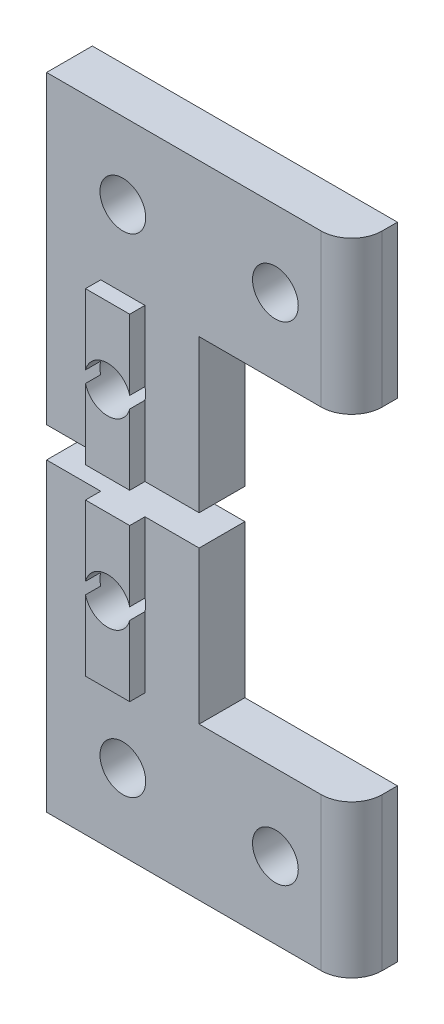
ISO-10303-21;
HEADER;
FILE_DESCRIPTION(('STEP AP214'),'2;1');
FILE_NAME('part.step','',(''),(''),'','','');
FILE_SCHEMA(('AUTOMOTIVE_DESIGN { 1 0 10303 214 1 1 1 1 }'));
ENDSEC;
DATA;
#1=APPLICATION_CONTEXT('core data for automotive mechanical design processes');
#2=APPLICATION_PROTOCOL_DEFINITION('international standard','automotive_design',2000,#1);
#3=PRODUCT_CONTEXT('',#1,'mechanical');
#4=PRODUCT('Part','Part','',(#3));
#5=PRODUCT_RELATED_PRODUCT_CATEGORY('part','',(#4));
#6=PRODUCT_DEFINITION_FORMATION('','',#4);
#7=PRODUCT_DEFINITION_CONTEXT('part definition',#1,'design');
#8=PRODUCT_DEFINITION('design','',#6,#7);
#9=PRODUCT_DEFINITION_SHAPE('','',#8);
#10=(LENGTH_UNIT() NAMED_UNIT(*) SI_UNIT(.MILLI.,.METRE.));
#11=(NAMED_UNIT(*) PLANE_ANGLE_UNIT() SI_UNIT($,.RADIAN.));
#12=(NAMED_UNIT(*) SI_UNIT($,.STERADIAN.) SOLID_ANGLE_UNIT());
#13=UNCERTAINTY_MEASURE_WITH_UNIT(LENGTH_MEASURE(1.E-05),#10,'distance_accuracy_value','');
#14=(GEOMETRIC_REPRESENTATION_CONTEXT(3) GLOBAL_UNCERTAINTY_ASSIGNED_CONTEXT((#13)) GLOBAL_UNIT_ASSIGNED_CONTEXT((#10,
#11,#12)) REPRESENTATION_CONTEXT('',''));
#15=CARTESIAN_POINT('',(0.,0.,0.));
#16=DIRECTION('',(0.,0.,1.));
#17=DIRECTION('',(1.,0.,0.));
#18=AXIS2_PLACEMENT_3D('',#15,#16,#17);
#19=CARTESIAN_POINT('',(3.55,22.,4.));
#20=DIRECTION('',(1.,0.,0.));
#21=DIRECTION('',(0.,-1.,0.));
#22=AXIS2_PLACEMENT_3D('',#19,#20,#21);
#23=PLANE('',#22);
#24=DIRECTION('',(0.,1.,0.));
#25=VECTOR('',#24,1.);
#26=CARTESIAN_POINT('',(3.55,22.,3.));
#27=LINE('',#26,#25);
#28=CARTESIAN_POINT('',(3.55,22.,3.));
#29=VERTEX_POINT('',#28);
#30=CARTESIAN_POINT('',(3.55,26.6159427126066,3.));
#31=VERTEX_POINT('',#30);
#32=EDGE_CURVE('E197',#29,#31,#27,.T.);
#33=ORIENTED_EDGE('',*,*,#32,.F.);
#34=DIRECTION('',(0.,0.,-1.));
#35=VECTOR('',#34,1.);
#36=CARTESIAN_POINT('',(3.55,22.,4.));
#37=LINE('',#36,#35);
#38=CARTESIAN_POINT('',(3.55,22.,4.));
#39=VERTEX_POINT('',#38);
#40=EDGE_CURVE('E196',#39,#29,#37,.T.);
#41=ORIENTED_EDGE('',*,*,#40,.F.);
#42=DIRECTION('',(0.,1.,0.));
#43=VECTOR('',#42,1.);
#44=CARTESIAN_POINT('',(3.55,22.,4.));
#45=LINE('',#44,#43);
#46=CARTESIAN_POINT('',(3.55,26.6159427126066,4.));
#47=VERTEX_POINT('',#46);
#48=EDGE_CURVE('E190',#39,#47,#45,.T.);
#49=ORIENTED_EDGE('',*,*,#48,.T.);
#50=DIRECTION('',(0.,0.,1.));
#51=VECTOR('',#50,1.);
#52=CARTESIAN_POINT('',(3.55,26.6159427126066,0.));
#53=LINE('',#52,#51);
#54=EDGE_CURVE('E171',#31,#47,#53,.T.);
#55=ORIENTED_EDGE('',*,*,#54,.F.);
#56=EDGE_LOOP('',(#33,#41,#49,#55));
#57=FACE_BOUND('',#56,.T.);
#58=ADVANCED_FACE('F43',(#57),#23,.F.);
#59=CARTESIAN_POINT('',(6.45,22.,4.));
#60=DIRECTION('',(-1.,0.,0.));
#61=DIRECTION('',(0.,1.,0.));
#62=AXIS2_PLACEMENT_3D('',#59,#60,#61);
#63=PLANE('',#62);
#64=DIRECTION('',(0.,-1.,0.));
#65=VECTOR('',#64,1.);
#66=CARTESIAN_POINT('',(6.45,22.,3.));
#67=LINE('',#66,#65);
#68=CARTESIAN_POINT('',(6.45,32.,3.));
#69=VERTEX_POINT('',#68);
#70=CARTESIAN_POINT('',(6.45,27.3840572873934,3.));
#71=VERTEX_POINT('',#70);
#72=EDGE_CURVE('E202',#69,#71,#67,.T.);
#73=ORIENTED_EDGE('',*,*,#72,.F.);
#74=DIRECTION('',(0.,0.,-1.));
#75=VECTOR('',#74,1.);
#76=CARTESIAN_POINT('',(6.45,32.,4.));
#77=LINE('',#76,#75);
#78=CARTESIAN_POINT('',(6.45,32.,4.));
#79=VERTEX_POINT('',#78);
#80=EDGE_CURVE('E209',#79,#69,#77,.T.);
#81=ORIENTED_EDGE('',*,*,#80,.F.);
#82=DIRECTION('',(0.,-1.,0.));
#83=VECTOR('',#82,1.);
#84=CARTESIAN_POINT('',(6.45,22.,4.));
#85=LINE('',#84,#83);
#86=CARTESIAN_POINT('',(6.45,27.3840572873934,4.));
#87=VERTEX_POINT('',#86);
#88=EDGE_CURVE('E166',#79,#87,#85,.T.);
#89=ORIENTED_EDGE('',*,*,#88,.T.);
#90=DIRECTION('',(0.,0.,1.));
#91=VECTOR('',#90,1.);
#92=CARTESIAN_POINT('',(6.45,27.3840572873934,0.));
#93=LINE('',#92,#91);
#94=EDGE_CURVE('E182',#71,#87,#93,.T.);
#95=ORIENTED_EDGE('',*,*,#94,.F.);
#96=EDGE_LOOP('',(#73,#81,#89,#95));
#97=FACE_BOUND('',#96,.T.);
#98=ADVANCED_FACE('F313',(#97),#63,.F.);
#99=CARTESIAN_POINT('',(0.,42.,4.));
#100=DIRECTION('',(0.,0.,1.));
#101=DIRECTION('',(1.,0.,0.));
#102=AXIS2_PLACEMENT_3D('',#99,#100,#101);
#103=PLANE('',#102);
#104=CARTESIAN_POINT('',(5.,27.,4.));
#105=DIRECTION('',(0.,0.,-1.));
#106=DIRECTION('',(1.,0.,0.));
#107=AXIS2_PLACEMENT_3D('',#104,#105,#106);
#108=CIRCLE('',#107,1.5);
#109=CARTESIAN_POINT('',(6.45,26.6159427126066,4.));
#110=VERTEX_POINT('',#109);
#111=EDGE_CURVE('E163',#110,#47,#108,.T.);
#112=ORIENTED_EDGE('',*,*,#111,.T.);
#113=ORIENTED_EDGE('',*,*,#48,.F.);
#114=DIRECTION('',(-1.,0.,0.));
#115=VECTOR('',#114,1.);
#116=CARTESIAN_POINT('',(3.55,22.,4.));
#117=LINE('',#116,#115);
#118=CARTESIAN_POINT('',(6.45,22.,4.));
#119=VERTEX_POINT('',#118);
#120=EDGE_CURVE('E165',#119,#39,#117,.T.);
#121=ORIENTED_EDGE('',*,*,#120,.F.);
#122=EDGE_CURVE('E151',#110,#119,#85,.T.);
#123=ORIENTED_EDGE('',*,*,#122,.F.);
#124=EDGE_LOOP('',(#112,#113,#121,#123));
#125=FACE_BOUND('',#124,.T.);
#126=ADVANCED_FACE('F161',(#125),#103,.T.);
#127=CARTESIAN_POINT('',(0.,22.,3.));
#128=DIRECTION('',(1.,0.,0.));
#129=DIRECTION('',(0.,-1.,0.));
#130=AXIS2_PLACEMENT_3D('',#127,#128,#129);
#131=PLANE('',#130);
#132=DIRECTION('',(0.,1.,0.));
#133=VECTOR('',#132,1.);
#134=CARTESIAN_POINT('',(0.,22.,0.));
#135=LINE('',#134,#133);
#136=CARTESIAN_POINT('',(0.,22.,0.));
#137=VERTEX_POINT('',#136);
#138=CARTESIAN_POINT('',(0.,42.,0.));
#139=VERTEX_POINT('',#138);
#140=EDGE_CURVE('E214',#137,#139,#135,.T.);
#141=ORIENTED_EDGE('',*,*,#140,.F.);
#142=DIRECTION('',(0.,0.,-1.));
#143=VECTOR('',#142,1.);
#144=CARTESIAN_POINT('',(0.,22.,3.));
#145=LINE('',#144,#143);
#146=CARTESIAN_POINT('',(0.,22.,3.));
#147=VERTEX_POINT('',#146);
#148=EDGE_CURVE('E232',#147,#137,#145,.T.);
#149=ORIENTED_EDGE('',*,*,#148,.F.);
#150=DIRECTION('',(0.,1.,0.));
#151=VECTOR('',#150,1.);
#152=CARTESIAN_POINT('',(0.,22.,3.));
#153=LINE('',#152,#151);
#154=CARTESIAN_POINT('',(0.,42.,3.));
#155=VERTEX_POINT('',#154);
#156=EDGE_CURVE('E215',#147,#155,#153,.T.);
#157=ORIENTED_EDGE('',*,*,#156,.T.);
#158=DIRECTION('',(0.,0.,-1.));
#159=VECTOR('',#158,1.);
#160=CARTESIAN_POINT('',(0.,42.,3.));
#161=LINE('',#160,#159);
#162=EDGE_CURVE('E262',#155,#139,#161,.T.);
#163=ORIENTED_EDGE('',*,*,#162,.T.);
#164=EDGE_LOOP('',(#141,#149,#157,#163));
#165=FACE_BOUND('',#164,.T.);
#166=ADVANCED_FACE('F291',(#165),#131,.F.);
#167=CARTESIAN_POINT('',(0.,42.,3.));
#168=DIRECTION('',(0.,-1.,0.));
#169=DIRECTION('',(0.,0.,1.));
#170=AXIS2_PLACEMENT_3D('',#167,#168,#169);
#171=PLANE('',#170);
#172=DIRECTION('',(0.,0.,-1.));
#173=VECTOR('',#172,1.);
#174=CARTESIAN_POINT('',(20.,42.,3.));
#175=LINE('',#174,#173);
#176=CARTESIAN_POINT('',(20.,42.,1.));
#177=VERTEX_POINT('',#176);
#178=CARTESIAN_POINT('',(20.,42.,0.));
#179=VERTEX_POINT('',#178);
#180=EDGE_CURVE('E259',#177,#179,#175,.T.);
#181=ORIENTED_EDGE('',*,*,#180,.T.);
#182=DIRECTION('',(1.,0.,0.));
#183=VECTOR('',#182,1.);
#184=CARTESIAN_POINT('',(0.,42.,0.));
#185=LINE('',#184,#183);
#186=EDGE_CURVE('E235',#139,#179,#185,.T.);
#187=ORIENTED_EDGE('',*,*,#186,.F.);
#188=ORIENTED_EDGE('',*,*,#162,.F.);
#189=DIRECTION('',(1.,0.,0.));
#190=VECTOR('',#189,1.);
#191=CARTESIAN_POINT('',(0.,42.,3.));
#192=LINE('',#191,#190);
#193=CARTESIAN_POINT('',(18.,42.,3.));
#194=VERTEX_POINT('',#193);
#195=EDGE_CURVE('E218',#155,#194,#192,.T.);
#196=ORIENTED_EDGE('',*,*,#195,.T.);
#197=CARTESIAN_POINT('',(18.,42.,1.));
#198=DIRECTION('',(0.,1.,0.));
#199=DIRECTION('',(0.,0.,1.));
#200=AXIS2_PLACEMENT_3D('',#197,#198,#199);
#201=CIRCLE('',#200,2.);
#202=EDGE_CURVE('E12',#177,#194,#201,.F.);
#203=ORIENTED_EDGE('',*,*,#202,.F.);
#204=EDGE_LOOP('',(#181,#187,#188,#196,#203));
#205=FACE_BOUND('',#204,.T.);
#206=ADVANCED_FACE('F285',(#205),#171,.F.);
#207=CARTESIAN_POINT('',(20.,42.,3.));
#208=DIRECTION('',(-1.,0.,0.));
#209=DIRECTION('',(0.,0.,1.));
#210=AXIS2_PLACEMENT_3D('',#207,#208,#209);
#211=PLANE('',#210);
#212=DIRECTION('',(0.,0.,-1.));
#213=VECTOR('',#212,1.);
#214=CARTESIAN_POINT('',(20.,32.,3.));
#215=LINE('',#214,#213);
#216=CARTESIAN_POINT('',(20.,32.,1.));
#217=VERTEX_POINT('',#216);
#218=CARTESIAN_POINT('',(20.,32.,0.));
#219=VERTEX_POINT('',#218);
#220=EDGE_CURVE('E256',#217,#219,#215,.T.);
#221=ORIENTED_EDGE('',*,*,#220,.T.);
#222=DIRECTION('',(0.,-1.,0.));
#223=VECTOR('',#222,1.);
#224=CARTESIAN_POINT('',(20.,42.,0.));
#225=LINE('',#224,#223);
#226=EDGE_CURVE('E238',#179,#219,#225,.T.);
#227=ORIENTED_EDGE('',*,*,#226,.F.);
#228=ORIENTED_EDGE('',*,*,#180,.F.);
#229=DIRECTION('',(0.,-1.,0.));
#230=VECTOR('',#229,1.);
#231=CARTESIAN_POINT('',(20.,42.,1.));
#232=LINE('',#231,#230);
#233=EDGE_CURVE('E51',#217,#177,#232,.F.);
#234=ORIENTED_EDGE('',*,*,#233,.F.);
#235=EDGE_LOOP('',(#221,#227,#228,#234));
#236=FACE_BOUND('',#235,.T.);
#237=ADVANCED_FACE('F283',(#236),#211,.F.);
#238=CARTESIAN_POINT('',(20.,32.,3.));
#239=DIRECTION('',(0.,1.,0.));
#240=DIRECTION('',(1.,0.,0.));
#241=AXIS2_PLACEMENT_3D('',#238,#239,#240);
#242=PLANE('',#241);
#243=DIRECTION('',(-1.,0.,0.));
#244=VECTOR('',#243,1.);
#245=CARTESIAN_POINT('',(20.,32.,3.));
#246=LINE('',#245,#244);
#247=CARTESIAN_POINT('',(18.,32.,3.));
#248=VERTEX_POINT('',#247);
#249=CARTESIAN_POINT('',(10.,32.,3.));
#250=VERTEX_POINT('',#249);
#251=EDGE_CURVE('E222',#248,#250,#246,.T.);
#252=ORIENTED_EDGE('',*,*,#251,.T.);
#253=DIRECTION('',(0.,0.,-1.));
#254=VECTOR('',#253,1.);
#255=CARTESIAN_POINT('',(10.,32.,3.));
#256=LINE('',#255,#254);
#257=CARTESIAN_POINT('',(10.,32.,0.));
#258=VERTEX_POINT('',#257);
#259=EDGE_CURVE('E253',#250,#258,#256,.T.);
#260=ORIENTED_EDGE('',*,*,#259,.T.);
#261=DIRECTION('',(-1.,0.,0.));
#262=VECTOR('',#261,1.);
#263=CARTESIAN_POINT('',(20.,32.,0.));
#264=LINE('',#263,#262);
#265=EDGE_CURVE('E241',#219,#258,#264,.T.);
#266=ORIENTED_EDGE('',*,*,#265,.F.);
#267=ORIENTED_EDGE('',*,*,#220,.F.);
#268=CARTESIAN_POINT('',(18.,32.,1.));
#269=DIRECTION('',(0.,-1.,0.));
#270=DIRECTION('',(1.,0.,0.));
#271=AXIS2_PLACEMENT_3D('',#268,#269,#270);
#272=CIRCLE('',#271,2.);
#273=EDGE_CURVE('E61',#248,#217,#272,.F.);
#274=ORIENTED_EDGE('',*,*,#273,.F.);
#275=EDGE_LOOP('',(#252,#260,#266,#267,#274));
#276=FACE_BOUND('',#275,.T.);
#277=ADVANCED_FACE('F273',(#276),#242,.F.);
#278=CARTESIAN_POINT('',(10.,32.,3.));
#279=DIRECTION('',(-1.,0.,0.));
#280=DIRECTION('',(0.,0.,1.));
#281=AXIS2_PLACEMENT_3D('',#278,#279,#280);
#282=PLANE('',#281);
#283=DIRECTION('',(0.,-1.,0.));
#284=VECTOR('',#283,1.);
#285=CARTESIAN_POINT('',(10.,32.,0.));
#286=LINE('',#285,#284);
#287=CARTESIAN_POINT('',(10.,22.,0.));
#288=VERTEX_POINT('',#287);
#289=EDGE_CURVE('E244',#258,#288,#286,.T.);
#290=ORIENTED_EDGE('',*,*,#289,.F.);
#291=ORIENTED_EDGE('',*,*,#259,.F.);
#292=DIRECTION('',(0.,-1.,0.));
#293=VECTOR('',#292,1.);
#294=CARTESIAN_POINT('',(10.,32.,3.));
#295=LINE('',#294,#293);
#296=CARTESIAN_POINT('',(10.,22.,3.));
#297=VERTEX_POINT('',#296);
#298=EDGE_CURVE('E225',#250,#297,#295,.T.);
#299=ORIENTED_EDGE('',*,*,#298,.T.);
#300=DIRECTION('',(0.,0.,-1.));
#301=VECTOR('',#300,1.);
#302=CARTESIAN_POINT('',(10.,22.,3.));
#303=LINE('',#302,#301);
#304=EDGE_CURVE('E250',#297,#288,#303,.T.);
#305=ORIENTED_EDGE('',*,*,#304,.T.);
#306=EDGE_LOOP('',(#290,#291,#299,#305));
#307=FACE_BOUND('',#306,.T.);
#308=ADVANCED_FACE('F278',(#307),#282,.F.);
#309=CARTESIAN_POINT('',(10.,22.,3.));
#310=DIRECTION('',(0.,1.,0.));
#311=DIRECTION('',(0.,0.,-1.));
#312=AXIS2_PLACEMENT_3D('',#309,#310,#311);
#313=PLANE('',#312);
#314=DIRECTION('',(-1.,0.,0.));
#315=VECTOR('',#314,1.);
#316=CARTESIAN_POINT('',(10.,22.,0.));
#317=LINE('',#316,#315);
#318=EDGE_CURVE('E219',#288,#137,#317,.T.);
#319=ORIENTED_EDGE('',*,*,#318,.F.);
#320=ORIENTED_EDGE('',*,*,#304,.F.);
#321=DIRECTION('',(-1.,0.,0.));
#322=VECTOR('',#321,1.);
#323=CARTESIAN_POINT('',(10.,22.,3.));
#324=LINE('',#323,#322);
#325=CARTESIAN_POINT('',(6.45,22.,3.));
#326=VERTEX_POINT('',#325);
#327=EDGE_CURVE('E229',#297,#326,#324,.T.);
#328=ORIENTED_EDGE('',*,*,#327,.T.);
#329=DIRECTION('',(0.,0.,-1.));
#330=VECTOR('',#329,1.);
#331=CARTESIAN_POINT('',(6.45,22.,4.));
#332=LINE('',#331,#330);
#333=EDGE_CURVE('E207',#119,#326,#332,.T.);
#334=ORIENTED_EDGE('',*,*,#333,.F.);
#335=ORIENTED_EDGE('',*,*,#120,.T.);
#336=ORIENTED_EDGE('',*,*,#40,.T.);
#337=EDGE_CURVE('E228',#29,#147,#324,.T.);
#338=ORIENTED_EDGE('',*,*,#337,.T.);
#339=ORIENTED_EDGE('',*,*,#148,.T.);
#340=EDGE_LOOP('',(#319,#320,#328,#334,#335,#336,#338,#339));
#341=FACE_BOUND('',#340,.T.);
#342=ADVANCED_FACE('F293',(#341),#313,.F.);
#343=CARTESIAN_POINT('',(0.,42.,3.));
#344=DIRECTION('',(0.,0.,1.));
#345=DIRECTION('',(1.,0.,0.));
#346=AXIS2_PLACEMENT_3D('',#343,#344,#345);
#347=PLANE('',#346);
#348=CARTESIAN_POINT('',(5.,37.,3.));
#349=DIRECTION('',(0.,0.,-1.));
#350=DIRECTION('',(1.,0.,0.));
#351=AXIS2_PLACEMENT_3D('',#348,#349,#350);
#352=CIRCLE('',#351,1.5);
#353=CARTESIAN_POINT('',(6.5,37.,3.));
#354=VERTEX_POINT('',#353);
#355=EDGE_CURVE('E173',#354,#354,#352,.T.);
#356=ORIENTED_EDGE('',*,*,#355,.T.);
#357=EDGE_LOOP('',(#356));
#358=FACE_BOUND('',#357,.T.);
#359=CARTESIAN_POINT('',(15.,37.,3.));
#360=DIRECTION('',(0.,0.,-1.));
#361=DIRECTION('',(1.,0.,0.));
#362=AXIS2_PLACEMENT_3D('',#359,#360,#361);
#363=CIRCLE('',#362,1.5);
#364=CARTESIAN_POINT('',(16.5,37.,3.));
#365=VERTEX_POINT('',#364);
#366=EDGE_CURVE('E178',#365,#365,#363,.T.);
#367=ORIENTED_EDGE('',*,*,#366,.T.);
#368=EDGE_LOOP('',(#367));
#369=FACE_BOUND('',#368,.T.);
#370=ORIENTED_EDGE('',*,*,#195,.F.);
#371=ORIENTED_EDGE('',*,*,#156,.F.);
#372=ORIENTED_EDGE('',*,*,#337,.F.);
#373=ORIENTED_EDGE('',*,*,#32,.T.);
#374=CARTESIAN_POINT('',(5.,27.,3.));
#375=DIRECTION('',(0.,0.,-1.));
#376=DIRECTION('',(1.,0.,0.));
#377=AXIS2_PLACEMENT_3D('',#374,#375,#376);
#378=CIRCLE('',#377,1.5);
#379=CARTESIAN_POINT('',(3.55,27.3840572873934,3.));
#380=VERTEX_POINT('',#379);
#381=EDGE_CURVE('E183',#31,#380,#378,.T.);
#382=ORIENTED_EDGE('',*,*,#381,.T.);
#383=CARTESIAN_POINT('',(3.55,32.,3.));
#384=VERTEX_POINT('',#383);
#385=EDGE_CURVE('E189',#380,#384,#27,.T.);
#386=ORIENTED_EDGE('',*,*,#385,.T.);
#387=DIRECTION('',(1.,0.,0.));
#388=VECTOR('',#387,1.);
#389=CARTESIAN_POINT('',(3.55,32.,3.));
#390=LINE('',#389,#388);
#391=EDGE_CURVE('E200',#384,#69,#390,.T.);
#392=ORIENTED_EDGE('',*,*,#391,.T.);
#393=ORIENTED_EDGE('',*,*,#72,.T.);
#394=CARTESIAN_POINT('',(6.45,26.6159427126066,3.));
#395=VERTEX_POINT('',#394);
#396=EDGE_CURVE('E157',#71,#395,#378,.T.);
#397=ORIENTED_EDGE('',*,*,#396,.T.);
#398=EDGE_CURVE('E153',#395,#326,#67,.T.);
#399=ORIENTED_EDGE('',*,*,#398,.T.);
#400=ORIENTED_EDGE('',*,*,#327,.F.);
#401=ORIENTED_EDGE('',*,*,#298,.F.);
#402=ORIENTED_EDGE('',*,*,#251,.F.);
#403=DIRECTION('',(0.,-1.,0.));
#404=VECTOR('',#403,1.);
#405=CARTESIAN_POINT('',(18.,32.,3.));
#406=LINE('',#405,#404);
#407=EDGE_CURVE('E267',#194,#248,#406,.T.);
#408=ORIENTED_EDGE('',*,*,#407,.F.);
#409=EDGE_LOOP('',(#370,#371,#372,#373,#382,#386,#392,#393,#397,#399,#400,#401,#402,#408));
#410=FACE_BOUND('',#409,.T.);
#411=ADVANCED_FACE('F274',(#358,#369,#410),#347,.T.);
#412=CARTESIAN_POINT('',(0.,42.,0.));
#413=DIRECTION('',(0.,0.,1.));
#414=DIRECTION('',(1.,0.,0.));
#415=AXIS2_PLACEMENT_3D('',#412,#413,#414);
#416=PLANE('',#415);
#417=CARTESIAN_POINT('',(5.,37.,0.));
#418=DIRECTION('',(0.,0.,-1.));
#419=DIRECTION('',(1.,0.,0.));
#420=AXIS2_PLACEMENT_3D('',#417,#418,#419);
#421=CIRCLE('',#420,1.5);
#422=CARTESIAN_POINT('',(6.5,37.,0.));
#423=VERTEX_POINT('',#422);
#424=EDGE_CURVE('E450',#423,#423,#421,.T.);
#425=ORIENTED_EDGE('',*,*,#424,.F.);
#426=EDGE_LOOP('',(#425));
#427=FACE_BOUND('',#426,.T.);
#428=CARTESIAN_POINT('',(15.,37.,0.));
#429=DIRECTION('',(0.,0.,-1.));
#430=DIRECTION('',(1.,0.,0.));
#431=AXIS2_PLACEMENT_3D('',#428,#429,#430);
#432=CIRCLE('',#431,1.5);
#433=CARTESIAN_POINT('',(16.5,37.,0.));
#434=VERTEX_POINT('',#433);
#435=EDGE_CURVE('E451',#434,#434,#432,.T.);
#436=ORIENTED_EDGE('',*,*,#435,.F.);
#437=EDGE_LOOP('',(#436));
#438=FACE_BOUND('',#437,.T.);
#439=CARTESIAN_POINT('',(5.,27.,0.));
#440=DIRECTION('',(0.,0.,-1.));
#441=DIRECTION('',(1.,0.,0.));
#442=AXIS2_PLACEMENT_3D('',#439,#440,#441);
#443=CIRCLE('',#442,1.5);
#444=CARTESIAN_POINT('',(6.5,27.,0.));
#445=VERTEX_POINT('',#444);
#446=EDGE_CURVE('E158',#445,#445,#443,.T.);
#447=ORIENTED_EDGE('',*,*,#446,.F.);
#448=EDGE_LOOP('',(#447));
#449=FACE_BOUND('',#448,.T.);
#450=ORIENTED_EDGE('',*,*,#140,.T.);
#451=ORIENTED_EDGE('',*,*,#186,.T.);
#452=ORIENTED_EDGE('',*,*,#226,.T.);
#453=ORIENTED_EDGE('',*,*,#265,.T.);
#454=ORIENTED_EDGE('',*,*,#289,.T.);
#455=ORIENTED_EDGE('',*,*,#318,.T.);
#456=EDGE_LOOP('',(#450,#451,#452,#453,#454,#455));
#457=FACE_BOUND('',#456,.T.);
#458=ADVANCED_FACE('F280',(#427,#438,#449,#457),#416,.F.);
#459=CARTESIAN_POINT('',(3.55,27.3840572873934,4.));
#460=VERTEX_POINT('',#459);
#461=CARTESIAN_POINT('',(3.55,32.,4.));
#462=VERTEX_POINT('',#461);
#463=EDGE_CURVE('E192',#460,#462,#45,.T.);
#464=ORIENTED_EDGE('',*,*,#463,.T.);
#465=DIRECTION('',(0.,0.,-1.));
#466=VECTOR('',#465,1.);
#467=CARTESIAN_POINT('',(3.55,32.,4.));
#468=LINE('',#467,#466);
#469=EDGE_CURVE('E212',#462,#384,#468,.T.);
#470=ORIENTED_EDGE('',*,*,#469,.T.);
#471=ORIENTED_EDGE('',*,*,#385,.F.);
#472=DIRECTION('',(0.,0.,1.));
#473=VECTOR('',#472,1.);
#474=CARTESIAN_POINT('',(3.55,27.3840572873934,0.));
#475=LINE('',#474,#473);
#476=EDGE_CURVE('E186',#460,#380,#475,.F.);
#477=ORIENTED_EDGE('',*,*,#476,.F.);
#478=EDGE_LOOP('',(#464,#470,#471,#477));
#479=FACE_BOUND('',#478,.T.);
#480=ADVANCED_FACE('F304',(#479),#23,.F.);
#481=CARTESIAN_POINT('',(3.55,32.,4.));
#482=DIRECTION('',(0.,-1.,0.));
#483=DIRECTION('',(0.,0.,1.));
#484=AXIS2_PLACEMENT_3D('',#481,#482,#483);
#485=PLANE('',#484);
#486=ORIENTED_EDGE('',*,*,#391,.F.);
#487=ORIENTED_EDGE('',*,*,#469,.F.);
#488=DIRECTION('',(1.,0.,0.));
#489=VECTOR('',#488,1.);
#490=CARTESIAN_POINT('',(3.55,32.,4.));
#491=LINE('',#490,#489);
#492=EDGE_CURVE('E167',#462,#79,#491,.T.);
#493=ORIENTED_EDGE('',*,*,#492,.T.);
#494=ORIENTED_EDGE('',*,*,#80,.T.);
#495=EDGE_LOOP('',(#486,#487,#493,#494));
#496=FACE_BOUND('',#495,.T.);
#497=ADVANCED_FACE('F308',(#496),#485,.F.);
#498=ORIENTED_EDGE('',*,*,#122,.T.);
#499=ORIENTED_EDGE('',*,*,#333,.T.);
#500=ORIENTED_EDGE('',*,*,#398,.F.);
#501=DIRECTION('',(0.,0.,1.));
#502=VECTOR('',#501,1.);
#503=CARTESIAN_POINT('',(6.45,26.6159427126066,0.));
#504=LINE('',#503,#502);
#505=EDGE_CURVE('E147',#110,#395,#504,.F.);
#506=ORIENTED_EDGE('',*,*,#505,.F.);
#507=EDGE_LOOP('',(#498,#499,#500,#506));
#508=FACE_BOUND('',#507,.T.);
#509=ADVANCED_FACE('F149',(#508),#63,.F.);
#510=CARTESIAN_POINT('',(5.,27.,4.));
#511=DIRECTION('',(0.,0.,-1.));
#512=DIRECTION('',(1.,0.,0.));
#513=AXIS2_PLACEMENT_3D('',#510,#511,#512);
#514=CIRCLE('',#513,1.5);
#515=EDGE_CURVE('E265',#460,#87,#514,.T.);
#516=ORIENTED_EDGE('',*,*,#515,.T.);
#517=ORIENTED_EDGE('',*,*,#88,.F.);
#518=ORIENTED_EDGE('',*,*,#492,.F.);
#519=ORIENTED_EDGE('',*,*,#463,.F.);
#520=EDGE_LOOP('',(#516,#517,#518,#519));
#521=FACE_BOUND('',#520,.T.);
#522=ADVANCED_FACE('F316',(#521),#103,.T.);
#523=CARTESIAN_POINT('',(5.,27.,0.));
#524=DIRECTION('',(0.,0.,1.));
#525=DIRECTION('',(1.,0.,0.));
#526=AXIS2_PLACEMENT_3D('',#523,#524,#525);
#527=CYLINDRICAL_SURFACE('',#526,1.5);
#528=ORIENTED_EDGE('',*,*,#446,.T.);
#529=EDGE_LOOP('',(#528));
#530=FACE_BOUND('',#529,.T.);
#531=ORIENTED_EDGE('',*,*,#381,.F.);
#532=ORIENTED_EDGE('',*,*,#54,.T.);
#533=ORIENTED_EDGE('',*,*,#111,.F.);
#534=ORIENTED_EDGE('',*,*,#505,.T.);
#535=ORIENTED_EDGE('',*,*,#396,.F.);
#536=ORIENTED_EDGE('',*,*,#94,.T.);
#537=ORIENTED_EDGE('',*,*,#515,.F.);
#538=ORIENTED_EDGE('',*,*,#476,.T.);
#539=EDGE_LOOP('',(#531,#532,#533,#534,#535,#536,#537,#538));
#540=FACE_BOUND('',#539,.T.);
#541=ADVANCED_FACE('F169',(#530,#540),#527,.F.);
#542=CARTESIAN_POINT('',(15.,37.,0.));
#543=DIRECTION('',(0.,0.,1.));
#544=DIRECTION('',(1.,0.,0.));
#545=AXIS2_PLACEMENT_3D('',#542,#543,#544);
#546=CYLINDRICAL_SURFACE('',#545,1.5);
#547=ORIENTED_EDGE('',*,*,#366,.F.);
#548=EDGE_LOOP('',(#547));
#549=FACE_BOUND('',#548,.T.);
#550=ORIENTED_EDGE('',*,*,#435,.T.);
#551=EDGE_LOOP('',(#550));
#552=FACE_BOUND('',#551,.T.);
#553=ADVANCED_FACE('F323',(#549,#552),#546,.F.);
#554=CARTESIAN_POINT('',(5.,37.,0.));
#555=DIRECTION('',(0.,0.,1.));
#556=DIRECTION('',(1.,0.,0.));
#557=AXIS2_PLACEMENT_3D('',#554,#555,#556);
#558=CYLINDRICAL_SURFACE('',#557,1.5);
#559=ORIENTED_EDGE('',*,*,#355,.F.);
#560=EDGE_LOOP('',(#559));
#561=FACE_BOUND('',#560,.T.);
#562=ORIENTED_EDGE('',*,*,#424,.T.);
#563=EDGE_LOOP('',(#562));
#564=FACE_BOUND('',#563,.T.);
#565=ADVANCED_FACE('F426',(#561,#564),#558,.F.);
#566=CARTESIAN_POINT('',(18.,42.,1.));
#567=DIRECTION('',(0.,1.,0.));
#568=DIRECTION('',(0.,0.,-1.));
#569=AXIS2_PLACEMENT_3D('',#566,#567,#568);
#570=CYLINDRICAL_SURFACE('',#569,2.);
#571=ORIENTED_EDGE('',*,*,#202,.T.);
#572=ORIENTED_EDGE('',*,*,#407,.T.);
#573=ORIENTED_EDGE('',*,*,#273,.T.);
#574=ORIENTED_EDGE('',*,*,#233,.T.);
#575=EDGE_LOOP('',(#571,#572,#573,#574));
#576=FACE_BOUND('',#575,.T.);
#577=ADVANCED_FACE('F45',(#576),#570,.T.);
#578=CLOSED_SHELL('',(#58,#98,#126,#166,#206,#237,#277,#308,#342,#411,#458,#480,#497,#509,#522,
#541,#553,#565,#577));
#579=MANIFOLD_SOLID_BREP('B2',#578);
#580=CARTESIAN_POINT('',(3.55,20.,4.));
#581=DIRECTION('',(1.,0.,0.));
#582=DIRECTION('',(0.,1.,0.));
#583=AXIS2_PLACEMENT_3D('',#580,#581,#582);
#584=PLANE('',#583);
#585=DIRECTION('',(0.,-1.,0.));
#586=VECTOR('',#585,1.);
#587=CARTESIAN_POINT('',(3.55,20.,3.));
#588=LINE('',#587,#586);
#589=CARTESIAN_POINT('',(3.55,20.,3.));
#590=VERTEX_POINT('',#589);
#591=CARTESIAN_POINT('',(3.55,15.3840572873934,3.));
#592=VERTEX_POINT('',#591);
#593=EDGE_CURVE('E634',#590,#592,#588,.T.);
#594=ORIENTED_EDGE('',*,*,#593,.T.);
#595=DIRECTION('',(0.,0.,1.));
#596=VECTOR('',#595,1.);
#597=CARTESIAN_POINT('',(3.55,15.3840572873934,0.));
#598=LINE('',#597,#596);
#599=CARTESIAN_POINT('',(3.55,15.3840572873934,4.));
#600=VERTEX_POINT('',#599);
#601=EDGE_CURVE('E725',#592,#600,#598,.T.);
#602=ORIENTED_EDGE('',*,*,#601,.T.);
#603=DIRECTION('',(0.,-1.,0.));
#604=VECTOR('',#603,1.);
#605=CARTESIAN_POINT('',(3.55,20.,4.));
#606=LINE('',#605,#604);
#607=CARTESIAN_POINT('',(3.55,20.,4.));
#608=VERTEX_POINT('',#607);
#609=EDGE_CURVE('E617',#608,#600,#606,.T.);
#610=ORIENTED_EDGE('',*,*,#609,.F.);
#611=DIRECTION('',(0.,0.,-1.));
#612=VECTOR('',#611,1.);
#613=CARTESIAN_POINT('',(3.55,20.,4.));
#614=LINE('',#613,#612);
#615=EDGE_CURVE('E633',#608,#590,#614,.T.);
#616=ORIENTED_EDGE('',*,*,#615,.T.);
#617=EDGE_LOOP('',(#594,#602,#610,#616));
#618=FACE_BOUND('',#617,.T.);
#619=ADVANCED_FACE('F495',(#618),#584,.F.);
#620=CARTESIAN_POINT('',(6.45,20.,4.));
#621=DIRECTION('',(-1.,0.,0.));
#622=DIRECTION('',(0.,-1.,0.));
#623=AXIS2_PLACEMENT_3D('',#620,#621,#622);
#624=PLANE('',#623);
#625=DIRECTION('',(0.,1.,0.));
#626=VECTOR('',#625,1.);
#627=CARTESIAN_POINT('',(6.45,20.,3.));
#628=LINE('',#627,#626);
#629=CARTESIAN_POINT('',(6.45,10.,3.));
#630=VERTEX_POINT('',#629);
#631=CARTESIAN_POINT('',(6.45,14.6159427126066,3.));
#632=VERTEX_POINT('',#631);
#633=EDGE_CURVE('E642',#630,#632,#628,.T.);
#634=ORIENTED_EDGE('',*,*,#633,.T.);
#635=DIRECTION('',(0.,0.,1.));
#636=VECTOR('',#635,1.);
#637=CARTESIAN_POINT('',(6.45,14.6159427126066,0.));
#638=LINE('',#637,#636);
#639=CARTESIAN_POINT('',(6.45,14.6159427126066,4.));
#640=VERTEX_POINT('',#639);
#641=EDGE_CURVE('E732',#632,#640,#638,.T.);
#642=ORIENTED_EDGE('',*,*,#641,.T.);
#643=DIRECTION('',(0.,1.,0.));
#644=VECTOR('',#643,1.);
#645=CARTESIAN_POINT('',(6.45,20.,4.));
#646=LINE('',#645,#644);
#647=CARTESIAN_POINT('',(6.45,10.,4.));
#648=VERTEX_POINT('',#647);
#649=EDGE_CURVE('E624',#648,#640,#646,.T.);
#650=ORIENTED_EDGE('',*,*,#649,.F.);
#651=DIRECTION('',(0.,0.,-1.));
#652=VECTOR('',#651,1.);
#653=CARTESIAN_POINT('',(6.45,10.,4.));
#654=LINE('',#653,#652);
#655=EDGE_CURVE('E649',#648,#630,#654,.T.);
#656=ORIENTED_EDGE('',*,*,#655,.T.);
#657=EDGE_LOOP('',(#634,#642,#650,#656));
#658=FACE_BOUND('',#657,.T.);
#659=ADVANCED_FACE('F765',(#658),#624,.F.);
#660=CARTESIAN_POINT('',(0.,0.,4.));
#661=DIRECTION('',(0.,0.,1.));
#662=DIRECTION('',(1.,0.,0.));
#663=AXIS2_PLACEMENT_3D('',#660,#661,#662);
#664=PLANE('',#663);
#665=CARTESIAN_POINT('',(5.,15.,4.));
#666=DIRECTION('',(0.,0.,1.));
#667=DIRECTION('',(1.,0.,0.));
#668=AXIS2_PLACEMENT_3D('',#665,#666,#667);
#669=CIRCLE('',#668,1.5);
#670=CARTESIAN_POINT('',(6.45,15.3840572873934,4.));
#671=VERTEX_POINT('',#670);
#672=EDGE_CURVE('E602',#671,#600,#669,.T.);
#673=ORIENTED_EDGE('',*,*,#672,.F.);
#674=CARTESIAN_POINT('',(6.45,20.,4.));
#675=VERTEX_POINT('',#674);
#676=EDGE_CURVE('E614',#671,#675,#646,.T.);
#677=ORIENTED_EDGE('',*,*,#676,.T.);
#678=DIRECTION('',(-1.,0.,0.));
#679=VECTOR('',#678,1.);
#680=CARTESIAN_POINT('',(3.55,20.,4.));
#681=LINE('',#680,#679);
#682=EDGE_CURVE('E628',#675,#608,#681,.T.);
#683=ORIENTED_EDGE('',*,*,#682,.T.);
#684=ORIENTED_EDGE('',*,*,#609,.T.);
#685=EDGE_LOOP('',(#673,#677,#683,#684));
#686=FACE_BOUND('',#685,.T.);
#687=ADVANCED_FACE('F613',(#686),#664,.T.);
#688=CARTESIAN_POINT('',(0.,20.,3.));
#689=DIRECTION('',(1.,0.,0.));
#690=DIRECTION('',(0.,1.,0.));
#691=AXIS2_PLACEMENT_3D('',#688,#689,#690);
#692=PLANE('',#691);
#693=DIRECTION('',(0.,-1.,0.));
#694=VECTOR('',#693,1.);
#695=CARTESIAN_POINT('',(0.,20.,0.));
#696=LINE('',#695,#694);
#697=CARTESIAN_POINT('',(0.,20.,0.));
#698=VERTEX_POINT('',#697);
#699=CARTESIAN_POINT('',(0.,0.,0.));
#700=VERTEX_POINT('',#699);
#701=EDGE_CURVE('E655',#698,#700,#696,.T.);
#702=ORIENTED_EDGE('',*,*,#701,.T.);
#703=DIRECTION('',(0.,0.,-1.));
#704=VECTOR('',#703,1.);
#705=CARTESIAN_POINT('',(0.,0.,3.));
#706=LINE('',#705,#704);
#707=CARTESIAN_POINT('',(0.,0.,3.));
#708=VERTEX_POINT('',#707);
#709=EDGE_CURVE('E697',#708,#700,#706,.T.);
#710=ORIENTED_EDGE('',*,*,#709,.F.);
#711=DIRECTION('',(0.,-1.,0.));
#712=VECTOR('',#711,1.);
#713=CARTESIAN_POINT('',(0.,20.,3.));
#714=LINE('',#713,#712);
#715=CARTESIAN_POINT('',(0.,20.,3.));
#716=VERTEX_POINT('',#715);
#717=EDGE_CURVE('E656',#716,#708,#714,.T.);
#718=ORIENTED_EDGE('',*,*,#717,.F.);
#719=DIRECTION('',(0.,0.,-1.));
#720=VECTOR('',#719,1.);
#721=CARTESIAN_POINT('',(0.,20.,3.));
#722=LINE('',#721,#720);
#723=EDGE_CURVE('E671',#716,#698,#722,.T.);
#724=ORIENTED_EDGE('',*,*,#723,.T.);
#725=EDGE_LOOP('',(#702,#710,#718,#724));
#726=FACE_BOUND('',#725,.T.);
#727=ADVANCED_FACE('F800',(#726),#692,.F.);
#728=CARTESIAN_POINT('',(0.,0.,3.));
#729=DIRECTION('',(0.,1.,0.));
#730=DIRECTION('',(0.,0.,1.));
#731=AXIS2_PLACEMENT_3D('',#728,#729,#730);
#732=PLANE('',#731);
#733=DIRECTION('',(0.,0.,-1.));
#734=VECTOR('',#733,1.);
#735=CARTESIAN_POINT('',(20.,0.,3.));
#736=LINE('',#735,#734);
#737=CARTESIAN_POINT('',(20.,0.,1.));
#738=VERTEX_POINT('',#737);
#739=CARTESIAN_POINT('',(20.,0.,0.));
#740=VERTEX_POINT('',#739);
#741=EDGE_CURVE('E695',#738,#740,#736,.T.);
#742=ORIENTED_EDGE('',*,*,#741,.F.);
#743=CARTESIAN_POINT('',(18.,0.,1.));
#744=DIRECTION('',(0.,1.,0.));
#745=DIRECTION('',(0.,0.,1.));
#746=AXIS2_PLACEMENT_3D('',#743,#744,#745);
#747=CIRCLE('',#746,2.);
#748=CARTESIAN_POINT('',(18.,0.,3.));
#749=VERTEX_POINT('',#748);
#750=EDGE_CURVE('E41',#738,#749,#747,.F.);
#751=ORIENTED_EDGE('',*,*,#750,.T.);
#752=DIRECTION('',(1.,0.,0.));
#753=VECTOR('',#752,1.);
#754=CARTESIAN_POINT('',(0.,0.,3.));
#755=LINE('',#754,#753);
#756=EDGE_CURVE('E659',#708,#749,#755,.T.);
#757=ORIENTED_EDGE('',*,*,#756,.F.);
#758=ORIENTED_EDGE('',*,*,#709,.T.);
#759=DIRECTION('',(1.,0.,0.));
#760=VECTOR('',#759,1.);
#761=CARTESIAN_POINT('',(0.,0.,0.));
#762=LINE('',#761,#760);
#763=EDGE_CURVE('E674',#700,#740,#762,.T.);
#764=ORIENTED_EDGE('',*,*,#763,.T.);
#765=EDGE_LOOP('',(#742,#751,#757,#758,#764));
#766=FACE_BOUND('',#765,.T.);
#767=ADVANCED_FACE('F802',(#766),#732,.F.);
#768=CARTESIAN_POINT('',(20.,0.,3.));
#769=DIRECTION('',(-1.,0.,0.));
#770=DIRECTION('',(0.,0.,1.));
#771=AXIS2_PLACEMENT_3D('',#768,#769,#770);
#772=PLANE('',#771);
#773=DIRECTION('',(0.,0.,-1.));
#774=VECTOR('',#773,1.);
#775=CARTESIAN_POINT('',(20.,10.,3.));
#776=LINE('',#775,#774);
#777=CARTESIAN_POINT('',(20.,10.,1.));
#778=VERTEX_POINT('',#777);
#779=CARTESIAN_POINT('',(20.,10.,0.));
#780=VERTEX_POINT('',#779);
#781=EDGE_CURVE('E693',#778,#780,#776,.T.);
#782=ORIENTED_EDGE('',*,*,#781,.F.);
#783=DIRECTION('',(0.,1.,0.));
#784=VECTOR('',#783,1.);
#785=CARTESIAN_POINT('',(20.,0.,1.));
#786=LINE('',#785,#784);
#787=EDGE_CURVE('E503',#778,#738,#786,.F.);
#788=ORIENTED_EDGE('',*,*,#787,.T.);
#789=ORIENTED_EDGE('',*,*,#741,.T.);
#790=DIRECTION('',(0.,1.,0.));
#791=VECTOR('',#790,1.);
#792=CARTESIAN_POINT('',(20.,0.,0.));
#793=LINE('',#792,#791);
#794=EDGE_CURVE('E677',#740,#780,#793,.T.);
#795=ORIENTED_EDGE('',*,*,#794,.T.);
#796=EDGE_LOOP('',(#782,#788,#789,#795));
#797=FACE_BOUND('',#796,.T.);
#798=ADVANCED_FACE('F804',(#797),#772,.F.);
#799=CARTESIAN_POINT('',(20.,10.,3.));
#800=DIRECTION('',(0.,-1.,0.));
#801=DIRECTION('',(1.,0.,0.));
#802=AXIS2_PLACEMENT_3D('',#799,#800,#801);
#803=PLANE('',#802);
#804=DIRECTION('',(-1.,0.,0.));
#805=VECTOR('',#804,1.);
#806=CARTESIAN_POINT('',(20.,10.,3.));
#807=LINE('',#806,#805);
#808=CARTESIAN_POINT('',(18.,10.,3.));
#809=VERTEX_POINT('',#808);
#810=CARTESIAN_POINT('',(10.,10.,3.));
#811=VERTEX_POINT('',#810);
#812=EDGE_CURVE('E663',#809,#811,#807,.T.);
#813=ORIENTED_EDGE('',*,*,#812,.F.);
#814=CARTESIAN_POINT('',(18.,10.,1.));
#815=DIRECTION('',(0.,-1.,0.));
#816=DIRECTION('',(1.,0.,0.));
#817=AXIS2_PLACEMENT_3D('',#814,#815,#816);
#818=CIRCLE('',#817,2.);
#819=EDGE_CURVE('E517',#809,#778,#818,.F.);
#820=ORIENTED_EDGE('',*,*,#819,.T.);
#821=ORIENTED_EDGE('',*,*,#781,.T.);
#822=DIRECTION('',(-1.,0.,0.));
#823=VECTOR('',#822,1.);
#824=CARTESIAN_POINT('',(20.,10.,0.));
#825=LINE('',#824,#823);
#826=CARTESIAN_POINT('',(10.,10.,0.));
#827=VERTEX_POINT('',#826);
#828=EDGE_CURVE('E680',#780,#827,#825,.T.);
#829=ORIENTED_EDGE('',*,*,#828,.T.);
#830=DIRECTION('',(0.,0.,-1.));
#831=VECTOR('',#830,1.);
#832=CARTESIAN_POINT('',(10.,10.,3.));
#833=LINE('',#832,#831);
#834=EDGE_CURVE('E690',#811,#827,#833,.T.);
#835=ORIENTED_EDGE('',*,*,#834,.F.);
#836=EDGE_LOOP('',(#813,#820,#821,#829,#835));
#837=FACE_BOUND('',#836,.T.);
#838=ADVANCED_FACE('F711',(#837),#803,.F.);
#839=CARTESIAN_POINT('',(10.,10.,3.));
#840=DIRECTION('',(-1.,0.,0.));
#841=DIRECTION('',(0.,0.,1.));
#842=AXIS2_PLACEMENT_3D('',#839,#840,#841);
#843=PLANE('',#842);
#844=DIRECTION('',(0.,1.,0.));
#845=VECTOR('',#844,1.);
#846=CARTESIAN_POINT('',(10.,10.,0.));
#847=LINE('',#846,#845);
#848=CARTESIAN_POINT('',(10.,20.,0.));
#849=VERTEX_POINT('',#848);
#850=EDGE_CURVE('E682',#827,#849,#847,.T.);
#851=ORIENTED_EDGE('',*,*,#850,.T.);
#852=DIRECTION('',(0.,0.,-1.));
#853=VECTOR('',#852,1.);
#854=CARTESIAN_POINT('',(10.,20.,3.));
#855=LINE('',#854,#853);
#856=CARTESIAN_POINT('',(10.,20.,3.));
#857=VERTEX_POINT('',#856);
#858=EDGE_CURVE('E687',#857,#849,#855,.T.);
#859=ORIENTED_EDGE('',*,*,#858,.F.);
#860=DIRECTION('',(0.,1.,0.));
#861=VECTOR('',#860,1.);
#862=CARTESIAN_POINT('',(10.,10.,3.));
#863=LINE('',#862,#861);
#864=EDGE_CURVE('E665',#811,#857,#863,.T.);
#865=ORIENTED_EDGE('',*,*,#864,.F.);
#866=ORIENTED_EDGE('',*,*,#834,.T.);
#867=EDGE_LOOP('',(#851,#859,#865,#866));
#868=FACE_BOUND('',#867,.T.);
#869=ADVANCED_FACE('F717',(#868),#843,.F.);
#870=CARTESIAN_POINT('',(10.,20.,3.));
#871=DIRECTION('',(0.,-1.,0.));
#872=DIRECTION('',(0.,0.,-1.));
#873=AXIS2_PLACEMENT_3D('',#870,#871,#872);
#874=PLANE('',#873);
#875=DIRECTION('',(-1.,0.,0.));
#876=VECTOR('',#875,1.);
#877=CARTESIAN_POINT('',(10.,20.,0.));
#878=LINE('',#877,#876);
#879=EDGE_CURVE('E660',#849,#698,#878,.T.);
#880=ORIENTED_EDGE('',*,*,#879,.T.);
#881=ORIENTED_EDGE('',*,*,#723,.F.);
#882=DIRECTION('',(-1.,0.,0.));
#883=VECTOR('',#882,1.);
#884=CARTESIAN_POINT('',(10.,20.,3.));
#885=LINE('',#884,#883);
#886=EDGE_CURVE('E667',#590,#716,#885,.T.);
#887=ORIENTED_EDGE('',*,*,#886,.F.);
#888=ORIENTED_EDGE('',*,*,#615,.F.);
#889=ORIENTED_EDGE('',*,*,#682,.F.);
#890=DIRECTION('',(0.,0.,-1.));
#891=VECTOR('',#890,1.);
#892=CARTESIAN_POINT('',(6.45,20.,4.));
#893=LINE('',#892,#891);
#894=CARTESIAN_POINT('',(6.45,20.,3.));
#895=VERTEX_POINT('',#894);
#896=EDGE_CURVE('E622',#675,#895,#893,.T.);
#897=ORIENTED_EDGE('',*,*,#896,.T.);
#898=EDGE_CURVE('E668',#857,#895,#885,.T.);
#899=ORIENTED_EDGE('',*,*,#898,.F.);
#900=ORIENTED_EDGE('',*,*,#858,.T.);
#901=EDGE_LOOP('',(#880,#881,#887,#888,#889,#897,#899,#900));
#902=FACE_BOUND('',#901,.T.);
#903=ADVANCED_FACE('F720',(#902),#874,.F.);
#904=CARTESIAN_POINT('',(0.,0.,3.));
#905=DIRECTION('',(0.,0.,1.));
#906=DIRECTION('',(1.,0.,0.));
#907=AXIS2_PLACEMENT_3D('',#904,#905,#906);
#908=PLANE('',#907);
#909=CARTESIAN_POINT('',(5.,5.,3.));
#910=DIRECTION('',(0.,0.,1.));
#911=DIRECTION('',(1.,0.,0.));
#912=AXIS2_PLACEMENT_3D('',#909,#910,#911);
#913=CIRCLE('',#912,1.5);
#914=CARTESIAN_POINT('',(6.5,5.,3.));
#915=VERTEX_POINT('',#914);
#916=EDGE_CURVE('E618',#915,#915,#913,.T.);
#917=ORIENTED_EDGE('',*,*,#916,.F.);
#918=EDGE_LOOP('',(#917));
#919=FACE_BOUND('',#918,.T.);
#920=CARTESIAN_POINT('',(15.,5.,3.));
#921=DIRECTION('',(0.,0.,1.));
#922=DIRECTION('',(1.,0.,0.));
#923=AXIS2_PLACEMENT_3D('',#920,#921,#922);
#924=CIRCLE('',#923,1.5);
#925=CARTESIAN_POINT('',(16.5,5.,3.));
#926=VERTEX_POINT('',#925);
#927=EDGE_CURVE('E740',#926,#926,#924,.T.);
#928=ORIENTED_EDGE('',*,*,#927,.F.);
#929=EDGE_LOOP('',(#928));
#930=FACE_BOUND('',#929,.T.);
#931=ORIENTED_EDGE('',*,*,#756,.T.);
#932=DIRECTION('',(0.,1.,0.));
#933=VECTOR('',#932,1.);
#934=CARTESIAN_POINT('',(18.,10.,3.));
#935=LINE('',#934,#933);
#936=EDGE_CURVE('E702',#749,#809,#935,.T.);
#937=ORIENTED_EDGE('',*,*,#936,.T.);
#938=ORIENTED_EDGE('',*,*,#812,.T.);
#939=ORIENTED_EDGE('',*,*,#864,.T.);
#940=ORIENTED_EDGE('',*,*,#898,.T.);
#941=CARTESIAN_POINT('',(6.45,15.3840572873934,3.));
#942=VERTEX_POINT('',#941);
#943=EDGE_CURVE('E641',#942,#895,#628,.T.);
#944=ORIENTED_EDGE('',*,*,#943,.F.);
#945=CARTESIAN_POINT('',(5.,15.,3.));
#946=DIRECTION('',(0.,0.,1.));
#947=DIRECTION('',(1.,0.,0.));
#948=AXIS2_PLACEMENT_3D('',#945,#946,#947);
#949=CIRCLE('',#948,1.5);
#950=EDGE_CURVE('E605',#632,#942,#949,.T.);
#951=ORIENTED_EDGE('',*,*,#950,.F.);
#952=ORIENTED_EDGE('',*,*,#633,.F.);
#953=DIRECTION('',(1.,0.,0.));
#954=VECTOR('',#953,1.);
#955=CARTESIAN_POINT('',(3.55,10.,3.));
#956=LINE('',#955,#954);
#957=CARTESIAN_POINT('',(3.55,10.,3.));
#958=VERTEX_POINT('',#957);
#959=EDGE_CURVE('E637',#958,#630,#956,.T.);
#960=ORIENTED_EDGE('',*,*,#959,.F.);
#961=CARTESIAN_POINT('',(3.55,14.6159427126066,3.));
#962=VERTEX_POINT('',#961);
#963=EDGE_CURVE('E638',#962,#958,#588,.T.);
#964=ORIENTED_EDGE('',*,*,#963,.F.);
#965=EDGE_CURVE('E728',#592,#962,#949,.T.);
#966=ORIENTED_EDGE('',*,*,#965,.F.);
#967=ORIENTED_EDGE('',*,*,#593,.F.);
#968=ORIENTED_EDGE('',*,*,#886,.T.);
#969=ORIENTED_EDGE('',*,*,#717,.T.);
#970=EDGE_LOOP('',(#931,#937,#938,#939,#940,#944,#951,#952,#960,#964,#966,#967,#968,#969));
#971=FACE_BOUND('',#970,.T.);
#972=ADVANCED_FACE('F707',(#919,#930,#971),#908,.T.);
#973=CARTESIAN_POINT('',(0.,0.,0.));
#974=DIRECTION('',(0.,0.,1.));
#975=DIRECTION('',(1.,0.,0.));
#976=AXIS2_PLACEMENT_3D('',#973,#974,#975);
#977=PLANE('',#976);
#978=CARTESIAN_POINT('',(5.,5.,0.));
#979=DIRECTION('',(0.,0.,1.));
#980=DIRECTION('',(1.,0.,0.));
#981=AXIS2_PLACEMENT_3D('',#978,#979,#980);
#982=CIRCLE('',#981,1.5);
#983=CARTESIAN_POINT('',(6.5,5.,0.));
#984=VERTEX_POINT('',#983);
#985=EDGE_CURVE('E743',#984,#984,#982,.T.);
#986=ORIENTED_EDGE('',*,*,#985,.T.);
#987=EDGE_LOOP('',(#986));
#988=FACE_BOUND('',#987,.T.);
#989=CARTESIAN_POINT('',(15.,5.,0.));
#990=DIRECTION('',(0.,0.,1.));
#991=DIRECTION('',(1.,0.,0.));
#992=AXIS2_PLACEMENT_3D('',#989,#990,#991);
#993=CIRCLE('',#992,1.5);
#994=CARTESIAN_POINT('',(16.5,5.,0.));
#995=VERTEX_POINT('',#994);
#996=EDGE_CURVE('E744',#995,#995,#993,.T.);
#997=ORIENTED_EDGE('',*,*,#996,.T.);
#998=EDGE_LOOP('',(#997));
#999=FACE_BOUND('',#998,.T.);
#1000=CARTESIAN_POINT('',(5.,15.,0.));
#1001=DIRECTION('',(0.,0.,1.));
#1002=DIRECTION('',(1.,0.,0.));
#1003=AXIS2_PLACEMENT_3D('',#1000,#1001,#1002);
#1004=CIRCLE('',#1003,1.5);
#1005=CARTESIAN_POINT('',(6.5,15.,0.));
#1006=VERTEX_POINT('',#1005);
#1007=EDGE_CURVE('E609',#1006,#1006,#1004,.T.);
#1008=ORIENTED_EDGE('',*,*,#1007,.T.);
#1009=EDGE_LOOP('',(#1008));
#1010=FACE_BOUND('',#1009,.T.);
#1011=ORIENTED_EDGE('',*,*,#701,.F.);
#1012=ORIENTED_EDGE('',*,*,#879,.F.);
#1013=ORIENTED_EDGE('',*,*,#850,.F.);
#1014=ORIENTED_EDGE('',*,*,#828,.F.);
#1015=ORIENTED_EDGE('',*,*,#794,.F.);
#1016=ORIENTED_EDGE('',*,*,#763,.F.);
#1017=EDGE_LOOP('',(#1011,#1012,#1013,#1014,#1015,#1016));
#1018=FACE_BOUND('',#1017,.T.);
#1019=ADVANCED_FACE('F750',(#988,#999,#1010,#1018),#977,.F.);
#1020=CARTESIAN_POINT('',(3.55,14.6159427126066,4.));
#1021=VERTEX_POINT('',#1020);
#1022=CARTESIAN_POINT('',(3.55,10.,4.));
#1023=VERTEX_POINT('',#1022);
#1024=EDGE_CURVE('E645',#1021,#1023,#606,.T.);
#1025=ORIENTED_EDGE('',*,*,#1024,.F.);
#1026=DIRECTION('',(0.,0.,1.));
#1027=VECTOR('',#1026,1.);
#1028=CARTESIAN_POINT('',(3.55,14.6159427126066,0.));
#1029=LINE('',#1028,#1027);
#1030=EDGE_CURVE('E729',#1021,#962,#1029,.F.);
#1031=ORIENTED_EDGE('',*,*,#1030,.T.);
#1032=ORIENTED_EDGE('',*,*,#963,.T.);
#1033=DIRECTION('',(0.,0.,-1.));
#1034=VECTOR('',#1033,1.);
#1035=CARTESIAN_POINT('',(3.55,10.,4.));
#1036=LINE('',#1035,#1034);
#1037=EDGE_CURVE('E652',#1023,#958,#1036,.T.);
#1038=ORIENTED_EDGE('',*,*,#1037,.F.);
#1039=EDGE_LOOP('',(#1025,#1031,#1032,#1038));
#1040=FACE_BOUND('',#1039,.T.);
#1041=ADVANCED_FACE('F767',(#1040),#584,.F.);
#1042=CARTESIAN_POINT('',(3.55,10.,4.));
#1043=DIRECTION('',(0.,1.,0.));
#1044=DIRECTION('',(0.,0.,1.));
#1045=AXIS2_PLACEMENT_3D('',#1042,#1043,#1044);
#1046=PLANE('',#1045);
#1047=ORIENTED_EDGE('',*,*,#959,.T.);
#1048=ORIENTED_EDGE('',*,*,#655,.F.);
#1049=DIRECTION('',(1.,0.,0.));
#1050=VECTOR('',#1049,1.);
#1051=CARTESIAN_POINT('',(3.55,10.,4.));
#1052=LINE('',#1051,#1050);
#1053=EDGE_CURVE('E625',#1023,#648,#1052,.T.);
#1054=ORIENTED_EDGE('',*,*,#1053,.F.);
#1055=ORIENTED_EDGE('',*,*,#1037,.T.);
#1056=EDGE_LOOP('',(#1047,#1048,#1054,#1055));
#1057=FACE_BOUND('',#1056,.T.);
#1058=ADVANCED_FACE('F776',(#1057),#1046,.F.);
#1059=ORIENTED_EDGE('',*,*,#676,.F.);
#1060=DIRECTION('',(0.,0.,1.));
#1061=VECTOR('',#1060,1.);
#1062=CARTESIAN_POINT('',(6.45,15.3840572873934,0.));
#1063=LINE('',#1062,#1061);
#1064=EDGE_CURVE('E599',#671,#942,#1063,.F.);
#1065=ORIENTED_EDGE('',*,*,#1064,.T.);
#1066=ORIENTED_EDGE('',*,*,#943,.T.);
#1067=ORIENTED_EDGE('',*,*,#896,.F.);
#1068=EDGE_LOOP('',(#1059,#1065,#1066,#1067));
#1069=FACE_BOUND('',#1068,.T.);
#1070=ADVANCED_FACE('F620',(#1069),#624,.F.);
#1071=CARTESIAN_POINT('',(5.,15.,4.));
#1072=DIRECTION('',(0.,0.,1.));
#1073=DIRECTION('',(1.,0.,0.));
#1074=AXIS2_PLACEMENT_3D('',#1071,#1072,#1073);
#1075=CIRCLE('',#1074,1.5);
#1076=EDGE_CURVE('E700',#1021,#640,#1075,.T.);
#1077=ORIENTED_EDGE('',*,*,#1076,.F.);
#1078=ORIENTED_EDGE('',*,*,#1024,.T.);
#1079=ORIENTED_EDGE('',*,*,#1053,.T.);
#1080=ORIENTED_EDGE('',*,*,#649,.T.);
#1081=EDGE_LOOP('',(#1077,#1078,#1079,#1080));
#1082=FACE_BOUND('',#1081,.T.);
#1083=ADVANCED_FACE('F790',(#1082),#664,.T.);
#1084=CARTESIAN_POINT('',(5.,15.,0.));
#1085=DIRECTION('',(0.,0.,1.));
#1086=DIRECTION('',(1.,0.,0.));
#1087=AXIS2_PLACEMENT_3D('',#1084,#1085,#1086);
#1088=CYLINDRICAL_SURFACE('',#1087,1.5);
#1089=ORIENTED_EDGE('',*,*,#1007,.F.);
#1090=EDGE_LOOP('',(#1089));
#1091=FACE_BOUND('',#1090,.T.);
#1092=ORIENTED_EDGE('',*,*,#965,.T.);
#1093=ORIENTED_EDGE('',*,*,#1030,.F.);
#1094=ORIENTED_EDGE('',*,*,#1076,.T.);
#1095=ORIENTED_EDGE('',*,*,#641,.F.);
#1096=ORIENTED_EDGE('',*,*,#950,.T.);
#1097=ORIENTED_EDGE('',*,*,#1064,.F.);
#1098=ORIENTED_EDGE('',*,*,#672,.T.);
#1099=ORIENTED_EDGE('',*,*,#601,.F.);
#1100=EDGE_LOOP('',(#1092,#1093,#1094,#1095,#1096,#1097,#1098,#1099));
#1101=FACE_BOUND('',#1100,.T.);
#1102=ADVANCED_FACE('F601',(#1091,#1101),#1088,.F.);
#1103=CARTESIAN_POINT('',(15.,5.,0.));
#1104=DIRECTION('',(0.,0.,1.));
#1105=DIRECTION('',(1.,0.,0.));
#1106=AXIS2_PLACEMENT_3D('',#1103,#1104,#1105);
#1107=CYLINDRICAL_SURFACE('',#1106,1.5);
#1108=ORIENTED_EDGE('',*,*,#927,.T.);
#1109=EDGE_LOOP('',(#1108));
#1110=FACE_BOUND('',#1109,.T.);
#1111=ORIENTED_EDGE('',*,*,#996,.F.);
#1112=EDGE_LOOP('',(#1111));
#1113=FACE_BOUND('',#1112,.T.);
#1114=ADVANCED_FACE('F755',(#1110,#1113),#1107,.F.);
#1115=CARTESIAN_POINT('',(5.,5.,0.));
#1116=DIRECTION('',(0.,0.,1.));
#1117=DIRECTION('',(1.,0.,0.));
#1118=AXIS2_PLACEMENT_3D('',#1115,#1116,#1117);
#1119=CYLINDRICAL_SURFACE('',#1118,1.5);
#1120=ORIENTED_EDGE('',*,*,#916,.T.);
#1121=EDGE_LOOP('',(#1120));
#1122=FACE_BOUND('',#1121,.T.);
#1123=ORIENTED_EDGE('',*,*,#985,.F.);
#1124=EDGE_LOOP('',(#1123));
#1125=FACE_BOUND('',#1124,.T.);
#1126=ADVANCED_FACE('F753',(#1122,#1125),#1119,.F.);
#1127=CARTESIAN_POINT('',(18.,0.,1.));
#1128=DIRECTION('',(0.,-1.,0.));
#1129=DIRECTION('',(0.,0.,-1.));
#1130=AXIS2_PLACEMENT_3D('',#1127,#1128,#1129);
#1131=CYLINDRICAL_SURFACE('',#1130,2.);
#1132=ORIENTED_EDGE('',*,*,#750,.F.);
#1133=ORIENTED_EDGE('',*,*,#787,.F.);
#1134=ORIENTED_EDGE('',*,*,#819,.F.);
#1135=ORIENTED_EDGE('',*,*,#936,.F.);
#1136=EDGE_LOOP('',(#1132,#1133,#1134,#1135));
#1137=FACE_BOUND('',#1136,.T.);
#1138=ADVANCED_FACE('F497',(#1137),#1131,.T.);
#1139=CLOSED_SHELL('',(#619,#659,#687,#727,#767,#798,#838,#869,#903,#972,#1019,#1041,#1058,
#1070,#1083,#1102,#1114,#1126,#1138));
#1140=MANIFOLD_SOLID_BREP('B6',#1139);
#1141=ADVANCED_BREP_SHAPE_REPRESENTATION('',(#18,#579,#1140),#14);
#1142=SHAPE_DEFINITION_REPRESENTATION(#9,#1141);
ENDSEC;
END-ISO-10303-21;
